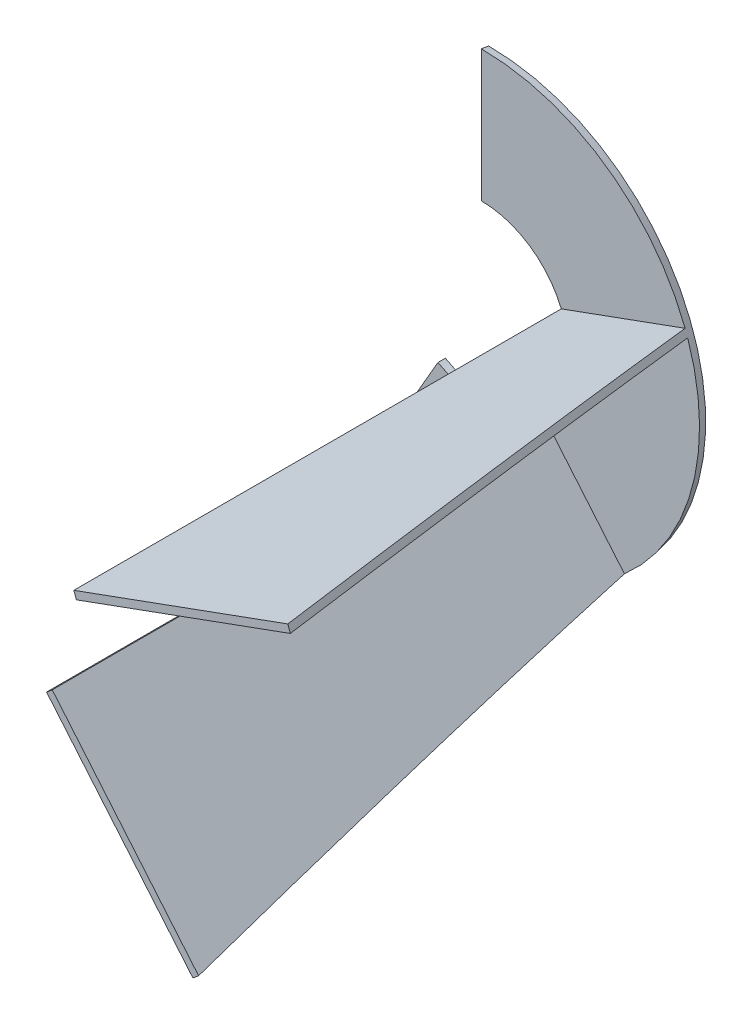
ISO-10303-21;
HEADER;
FILE_DESCRIPTION(('STEP AP214'),'2;1');
FILE_NAME('part.step','',(''),(''),'','','');
FILE_SCHEMA(('AUTOMOTIVE_DESIGN { 1 0 10303 214 1 1 1 1 }'));
ENDSEC;
DATA;
#1=APPLICATION_CONTEXT('core data for automotive mechanical design processes');
#2=APPLICATION_PROTOCOL_DEFINITION('international standard','automotive_design',2000,#1);
#3=PRODUCT_CONTEXT('',#1,'mechanical');
#4=PRODUCT('Part','Part','',(#3));
#5=PRODUCT_RELATED_PRODUCT_CATEGORY('part','',(#4));
#6=PRODUCT_DEFINITION_FORMATION('','',#4);
#7=PRODUCT_DEFINITION_CONTEXT('part definition',#1,'design');
#8=PRODUCT_DEFINITION('design','',#6,#7);
#9=PRODUCT_DEFINITION_SHAPE('','',#8);
#10=(LENGTH_UNIT() NAMED_UNIT(*) SI_UNIT(.MILLI.,.METRE.));
#11=(NAMED_UNIT(*) PLANE_ANGLE_UNIT() SI_UNIT($,.RADIAN.));
#12=(NAMED_UNIT(*) SI_UNIT($,.STERADIAN.) SOLID_ANGLE_UNIT());
#13=UNCERTAINTY_MEASURE_WITH_UNIT(LENGTH_MEASURE(1.E-05),#10,'distance_accuracy_value','');
#14=(GEOMETRIC_REPRESENTATION_CONTEXT(3) GLOBAL_UNCERTAINTY_ASSIGNED_CONTEXT((#13)) GLOBAL_UNIT_ASSIGNED_CONTEXT((#10,
#11,#12)) REPRESENTATION_CONTEXT('',''));
#15=CARTESIAN_POINT('',(0.,0.,0.));
#16=DIRECTION('',(0.,0.,1.));
#17=DIRECTION('',(1.,0.,0.));
#18=AXIS2_PLACEMENT_3D('',#15,#16,#17);
#19=CARTESIAN_POINT('',(-87.4510900266484,6.49566910726212,0.));
#20=CARTESIAN_POINT('',(-125.095140394617,-21.9135996506971,200.));
#21=CARTESIAN_POINT('',(-100.442428241173,-168.406510946035,0.));
#22=CARTESIAN_POINT('',(-81.267941093223,-272.103880439931,200.));
#23=CARTESIAN_POINT('',(74.4597518121241,-181.397849160559,0.));
#24=CARTESIAN_POINT('',(168.922339696011,-228.276681138537,200.));
#25=CARTESIAN_POINT('',(87.4510900266484,-6.49566910726216,0.));
#26=CARTESIAN_POINT('',(125.095140394617,21.913599650697,200.));
#27=CARTESIAN_POINT('',(100.442428241173,168.406510946035,0.));
#28=CARTESIAN_POINT('',(81.2679410932231,272.103880439931,200.));
#29=CARTESIAN_POINT('',(-74.4597518121241,181.397849160559,0.));
#30=CARTESIAN_POINT('',(-168.922339696011,228.276681138537,200.));
#31=CARTESIAN_POINT('',(-87.4510900266484,6.49566910726212,0.));
#32=CARTESIAN_POINT('',(-125.095140394617,-21.9135996506971,200.));
#33=(BOUNDED_SURFACE() B_SPLINE_SURFACE(3,1,((#19,#20),(#21,#22),(#23,#24),(#25,#26),(#27,#28),
(#29,#30),(#31,#32)),.UNSPECIFIED.,.T.,.F.,.F.) B_SPLINE_SURFACE_WITH_KNOTS((4,3,4),(2,2),(0.,
0.5,1.),(0.,1.),.UNSPECIFIED.) GEOMETRIC_REPRESENTATION_ITEM() RATIONAL_B_SPLINE_SURFACE(((1.,
1.),(0.333333333333334,0.333333333333334),(0.333333333333334,0.333333333333334),(1.,1.),
(0.333333333333333,0.333333333333333),(0.333333333333333,0.333333333333333),(1.,1.))) REPRESENTATION_ITEM('') SURFACE());
#34=CARTESIAN_POINT('',(0.,0.,200.));
#35=DIRECTION('',(0.,0.,1.));
#36=DIRECTION('',(1.,0.,0.));
#37=AXIS2_PLACEMENT_3D('',#34,#35,#36);
#38=CIRCLE('',#37,127.);
#39=CARTESIAN_POINT('',(80.479265582188,-98.2450396272079,200.));
#40=VERTEX_POINT('',#39);
#41=CARTESIAN_POINT('',(82.777398911545,-96.3166767981483,200.));
#42=VERTEX_POINT('',#41);
#43=EDGE_CURVE('E304',#40,#42,#38,.T.);
#44=CARTESIAN_POINT('',(80.4792655821881,-98.2450396272079,200.));
#45=CARTESIAN_POINT('',(79.8258986955483,-97.4663872927729,195.15787414735));
#46=CARTESIAN_POINT('',(79.1744886529553,-96.6900670342607,190.315108471509));
#47=CARTESIAN_POINT('',(77.875904815618,-95.1424750808292,180.628190339728));
#48=CARTESIAN_POINT('',(77.2287310313074,-94.3712033983442,175.784037880403));
#49=CARTESIAN_POINT('',(75.9389449465244,-92.834096198126,166.094258801684));
#50=CARTESIAN_POINT('',(75.2963326499015,-92.0682606849805,161.248632181051));
#51=CARTESIAN_POINT('',(74.0160222202433,-90.5424461307995,151.555706284349));
#52=CARTESIAN_POINT('',(73.3783241861355,-89.7824672076612,146.70840697665));
#53=CARTESIAN_POINT('',(72.1082543767335,-88.2688569494609,137.012122894263));
#54=CARTESIAN_POINT('',(71.4758825975654,-87.5152256097822,132.163138120803));
#55=CARTESIAN_POINT('',(70.2169081151739,-86.0148382474076,122.463359330206));
#56=CARTESIAN_POINT('',(69.5903054088664,-85.2680822210364,117.612565314037));
#57=CARTESIAN_POINT('',(67.7936105986119,-83.1268647261203,103.631129904761));
#58=CARTESIAN_POINT('',(66.6314530237928,-81.7418592611689,94.4980162577177));
#59=CARTESIAN_POINT('',(64.3329726262792,-79.0026369899247,76.223994994572));
#60=CARTESIAN_POINT('',(63.1966495743179,-77.6484199104022,67.0830874483839));
#61=CARTESIAN_POINT('',(61.5148886903606,-75.6441753350617,53.3645224337641));
#62=CARTESIAN_POINT('',(60.9580621199263,-74.9805752692946,48.790241122104));
#63=CARTESIAN_POINT('',(59.8526683944306,-73.663218325704,39.6392649211112));
#64=CARTESIAN_POINT('',(59.3041012345709,-73.009461442162,35.0625700331823));
#65=CARTESIAN_POINT('',(58.2159287358204,-71.7126279574139,25.9065269590137));
#66=CARTESIAN_POINT('',(57.6763235368623,-71.069551522973,21.3271787324979));
#67=CARTESIAN_POINT('',(56.6068912000624,-69.7950516935553,12.1657107224982));
#68=CARTESIAN_POINT('',(56.0770640823663,-69.1636283225872,7.58359093332422));
#69=CARTESIAN_POINT('',(55.5525308558803,-68.5385139654875,3.00000000000001));
#70=B_SPLINE_CURVE_WITH_KNOTS('',3,(#44,#45,#46,#47,#48,#49,#50,#51,#52,#53,#54,#55,#56,#57,#58,
#59,#60,#61,#62,#63,#64,#65,#66,#67,#68,#69),.UNSPECIFIED.,.F.,.F.,(4,2,2,2,2,2,2,2,2,2,2,2,4),
(0.,14.8429895337898,29.686015611385,44.5290542137138,59.3723908402982,74.2157166702322,
89.0590345647813,116.990006932346,144.920731331384,158.887470726775,172.854202007863,
186.82115116169,200.788129088241),.UNSPECIFIED.);
#71=CARTESIAN_POINT('',(55.5525308558803,-68.5385139654875,3.));
#72=VERTEX_POINT('',#71);
#73=EDGE_CURVE('E389',#40,#72,#70,.T.);
#74=CARTESIAN_POINT('',(0.,0.,3.));
#75=DIRECTION('',(0.,0.,1.));
#76=DIRECTION('',(1.,0.,0.));
#77=AXIS2_PLACEMENT_3D('',#74,#75,#76);
#78=CIRCLE('',#77,88.2247787250887);
#79=CARTESIAN_POINT('',(-44.1123893625439,-76.4048996191879,3.));
#80=VERTEX_POINT('',#79);
#81=EDGE_CURVE('E393',#72,#80,#78,.F.);
#82=CARTESIAN_POINT('',(-63.4999999999993,-109.985226280624,200.));
#83=CARTESIAN_POINT('',(-62.9918050443149,-109.105006797228,195.157862814135));
#84=CARTESIAN_POINT('',(-62.4851329677572,-108.227425017854,190.315085545337));
#85=CARTESIAN_POINT('',(-61.4750855690972,-106.477971605322,180.628143787621));
#86=CARTESIAN_POINT('',(-60.9717102550489,-105.606099986115,175.783979295344));
#87=CARTESIAN_POINT('',(-59.9685094440528,-103.868505211275,166.094175646622));
#88=CARTESIAN_POINT('',(-59.4686839500642,-103.002782060768,161.24853648895));
#89=CARTESIAN_POINT('',(-58.4728565784787,-101.277958457615,151.555578822597));
#90=CARTESIAN_POINT('',(-57.9768547827149,-100.418858146706,146.708260280281));
#91=CARTESIAN_POINT('',(-56.9889960386355,-98.7078366112596,137.011937090917));
#92=CARTESIAN_POINT('',(-56.4971390873482,-97.8559153815739,132.16293244508));
#93=CARTESIAN_POINT('',(-55.5179147336459,-96.1598490489527,122.46311321015));
#94=CARTESIAN_POINT('',(-55.0305473289263,-95.3157039420254,117.612298621988));
#95=CARTESIAN_POINT('',(-53.6082178048955,-92.8521569412988,103.381928799494));
#96=CARTESIAN_POINT('',(-52.6799050105118,-91.24427201611,93.9997100770592));
#97=CARTESIAN_POINT('',(-50.8445827044154,-88.0654005336864,75.2270194397784));
#98=CARTESIAN_POINT('',(-49.937572989613,-86.4944136246902,65.8365476044983));
#99=CARTESIAN_POINT('',(-48.5958812721245,-84.1705354019058,51.7431632196798));
#100=CARTESIAN_POINT('',(-48.1517648480518,-83.401303190936,47.0438402078543));
#101=CARTESIAN_POINT('',(-47.2703910750344,-81.8747190356112,37.6426233430513));
#102=CARTESIAN_POINT('',(-46.8331337216448,-81.1173670835573,32.9407294917418));
#103=CARTESIAN_POINT('',(-45.9660787641127,-79.6155838441571,23.5341070341163));
#104=CARTESIAN_POINT('',(-45.5362812865867,-78.8711527761173,18.8293783810847));
#105=CARTESIAN_POINT('',(-44.6848466474256,-77.396424721766,9.4169580477619));
#106=CARTESIAN_POINT('',(-44.2632095045406,-76.6661277679309,4.7092663606881));
#107=CARTESIAN_POINT('',(-43.8459999999996,-75.9434997086652,0.));
#108=B_SPLINE_CURVE_WITH_KNOTS('',3,(#82,#83,#84,#85,#86,#87,#88,#89,#90,#91,#92,#93,#94,#95,
#96,#97,#98,#99,#100,#101,#102,#103,#104,#105,#106,#107),.UNSPECIFIED.,.F.,.F.,(4,2,2,2,2,2,2,2,
2,2,2,2,4),(0.,14.8429805767852,29.6859974010277,44.529026597607,59.3723725807232,
74.2157079200028,89.0590356392168,117.751420452957,146.443531621257,160.791105142822,
175.138669366289,189.48647687351,203.834317344135),.UNSPECIFIED.);
#109=CARTESIAN_POINT('',(-43.8459999999996,-75.9434997086652,0.));
#110=VERTEX_POINT('',#109);
#111=EDGE_CURVE('E190',#80,#110,#108,.T.);
#112=CARTESIAN_POINT('',(0.,0.,0.));
#113=DIRECTION('',(0.,0.,1.));
#114=DIRECTION('',(1.,0.,0.));
#115=AXIS2_PLACEMENT_3D('',#112,#113,#114);
#116=CIRCLE('',#115,87.692);
#117=CARTESIAN_POINT('',(1.17799163178258E-13,87.692,0.));
#118=VERTEX_POINT('',#117);
#119=EDGE_CURVE('E220',#110,#118,#116,.T.);
#120=CARTESIAN_POINT('',(0.,127.,200.));
#121=CARTESIAN_POINT('',(0.,125.983610088631,195.157862814135));
#122=CARTESIAN_POINT('',(0.,124.970265935516,190.315085545337));
#123=CARTESIAN_POINT('',(0.,122.950171138196,180.628143787621));
#124=CARTESIAN_POINT('',(0.,121.943420510099,175.783979295344));
#125=CARTESIAN_POINT('',(0.,119.937018888107,166.094175646622));
#126=CARTESIAN_POINT('',(0.,118.93736790013,161.24853648895));
#127=CARTESIAN_POINT('',(0.,116.945713156959,151.555578822597));
#128=CARTESIAN_POINT('',(0.,115.953709565431,146.708260280281));
#129=CARTESIAN_POINT('',(0.,113.977992077272,137.011937090917));
#130=CARTESIAN_POINT('',(0.,112.994278174697,132.16293244508));
#131=CARTESIAN_POINT('',(0.,111.035829467293,122.46311321015));
#132=CARTESIAN_POINT('',(0.,110.061094657854,117.612298621988));
#133=CARTESIAN_POINT('',(0.,107.216435609792,103.381928799494));
#134=CARTESIAN_POINT('',(0.,105.359810021025,93.9997100770591));
#135=CARTESIAN_POINT('',(0.,101.689165408832,75.2270194397784));
#136=CARTESIAN_POINT('',(0.,99.875145979227,65.8365476044983));
#137=CARTESIAN_POINT('',(0.,97.1917625442501,51.7431632196798));
#138=CARTESIAN_POINT('',(0.,96.3035296961046,47.0438402078543));
#139=CARTESIAN_POINT('',(0.,94.5407821500698,37.6426233430513));
#140=CARTESIAN_POINT('',(0.,93.6662674432906,32.9407294917418));
#141=CARTESIAN_POINT('',(0.,91.9321575282263,23.5341070341163));
#142=CARTESIAN_POINT('',(0.,91.0725625731745,18.8293783810847));
#143=CARTESIAN_POINT('',(0.,89.3696932948521,9.4169580477619));
#144=CARTESIAN_POINT('',(0.,88.526419009082,4.7092663606881));
#145=CARTESIAN_POINT('',(1.17799163178258E-13,87.692,0.));
#146=B_SPLINE_CURVE_WITH_KNOTS('',3,(#120,#121,#122,#123,#124,#125,#126,#127,#128,#129,#130,
#131,#132,#133,#134,#135,#136,#137,#138,#139,#140,#141,#142,#143,#144,#145),.UNSPECIFIED.,.F.,
.F.,(4,2,2,2,2,2,2,2,2,2,2,2,4),(0.,14.8429805767853,29.6859974010277,44.529026597607,
59.3723725807232,74.2157079200028,89.0590356392168,117.751420452957,146.443531621257,
160.791105142822,175.138669366289,189.48647687351,203.834317344135),.UNSPECIFIED.);
#147=CARTESIAN_POINT('',(0.,88.2247787250886,3.));
#148=VERTEX_POINT('',#147);
#149=EDGE_CURVE('E223',#148,#118,#146,.T.);
#150=CARTESIAN_POINT('',(0.,0.,3.));
#151=DIRECTION('',(0.,0.,1.));
#152=DIRECTION('',(1.,0.,0.));
#153=AXIS2_PLACEMENT_3D('',#150,#151,#152);
#154=CIRCLE('',#153,88.2247787250886);
#155=CARTESIAN_POINT('',(82.3791599484552,31.5798288038058,3.));
#156=VERTEX_POINT('',#155);
#157=EDGE_CURVE('E351',#148,#156,#154,.F.);
#158=CARTESIAN_POINT('',(118.819608285694,44.8430673218758,200.));
#159=CARTESIAN_POINT('',(117.864449796655,44.4954180628589,195.15787414735));
#160=CARTESIAN_POINT('',(116.912152022233,44.1488100188114,190.315108471509));
#161=CARTESIAN_POINT('',(115.013749453439,43.457847991116,180.628190339728));
#162=CARTESIAN_POINT('',(114.06764467432,43.1134940130198,175.784037880403));
#163=CARTESIAN_POINT('',(112.182103559341,42.4272131716824,166.094258801684));
#164=CARTESIAN_POINT('',(111.242667229109,42.0852863104895,161.248632181051));
#165=CARTESIAN_POINT('',(109.370978595204,41.4040473599338,151.555706284349));
#166=CARTESIAN_POINT('',(108.438726436154,41.0647353232093,146.70840697665));
#167=CARTESIAN_POINT('',(106.582008587532,40.3889452928801,137.012122894263));
#168=CARTESIAN_POINT('',(105.657542892297,40.0524672972143,132.163138120803));
#169=CARTESIAN_POINT('',(103.817045326642,39.3825809670765,122.463359330206));
#170=CARTESIAN_POINT('',(102.901013451714,39.0491726309637,117.612565314037));
#171=CARTESIAN_POINT('',(100.274421355728,38.0931712904659,103.631129904761));
#172=CARTESIAN_POINT('',(98.5754606402588,37.4748001608473,94.4980162577178));
#173=CARTESIAN_POINT('',(95.2153070902893,36.2518042860946,76.223994994572));
#174=CARTESIAN_POINT('',(93.5541139206237,35.64717941897,67.0830874483839));
#175=CARTESIAN_POINT('',(91.0955439843555,34.7523331433066,53.3645224337641));
#176=CARTESIAN_POINT('',(90.2815179959737,34.4560519136165,48.7902411221041));
#177=CARTESIAN_POINT('',(88.6655404767152,33.867884197363,39.6392649211113));
#178=CARTESIAN_POINT('',(87.8635889388238,33.5759977082466,35.0625700331823));
#179=CARTESIAN_POINT('',(86.2727871688322,32.9969932153517,25.9065269590138));
#180=CARTESIAN_POINT('',(85.4839371412999,32.7098752860298,21.3271787324979));
#181=CARTESIAN_POINT('',(83.9205316552938,32.1408422250351,12.1657107224982));
#182=CARTESIAN_POINT('',(83.145976226271,31.8589271040815,7.58359093332422));
#183=CARTESIAN_POINT('',(82.3791599484553,31.5798288038058,3.00000000000001));
#184=B_SPLINE_CURVE_WITH_KNOTS('',3,(#158,#159,#160,#161,#162,#163,#164,#165,#166,#167,#168,
#169,#170,#171,#172,#173,#174,#175,#176,#177,#178,#179,#180,#181,#182,#183),.UNSPECIFIED.,.F.,
.F.,(4,2,2,2,2,2,2,2,2,2,2,2,4),(0.,14.8429895337898,29.686015611385,44.5290542137138,
59.3723908402981,74.2157166702321,89.0590345647812,116.990006932346,144.920731331384,
158.887470726775,172.854202007863,186.82115116169,200.788129088241),.UNSPECIFIED.);
#185=CARTESIAN_POINT('',(118.819608285694,44.8430673218758,200.));
#186=VERTEX_POINT('',#185);
#187=EDGE_CURVE('E349',#186,#156,#184,.T.);
#188=CARTESIAN_POINT('',(119.845668715671,42.0239894595181,200.));
#189=VERTEX_POINT('',#188);
#190=EDGE_CURVE('E289',#189,#186,#38,.T.);
#191=CARTESIAN_POINT('',(119.845668715671,42.0239894595181,200.));
#192=CARTESIAN_POINT('',(118.890510226632,41.6763402005012,195.15787414735));
#193=CARTESIAN_POINT('',(117.93821245221,41.3297321564537,190.315108471509));
#194=CARTESIAN_POINT('',(116.039809883416,40.6387701287583,180.628190339728));
#195=CARTESIAN_POINT('',(115.093705104297,40.294416150662,175.784037880403));
#196=CARTESIAN_POINT('',(113.208163989318,39.6081353093246,166.094258801684));
#197=CARTESIAN_POINT('',(112.268727659086,39.2662084481318,161.248632181051));
#198=CARTESIAN_POINT('',(110.397039025181,38.5849694975761,151.555706284349));
#199=CARTESIAN_POINT('',(109.464786866131,38.2456574608515,146.70840697665));
#200=CARTESIAN_POINT('',(107.608069017509,37.5698674305224,137.012122894263));
#201=CARTESIAN_POINT('',(106.683603322274,37.2333894348565,132.163138120803));
#202=CARTESIAN_POINT('',(104.843105756619,36.5635031047188,122.463359330206));
#203=CARTESIAN_POINT('',(103.927073881691,36.230094768606,117.612565314037));
#204=CARTESIAN_POINT('',(101.300481785705,35.2740934281082,103.631129904761));
#205=CARTESIAN_POINT('',(99.6015210702358,34.6557222984896,94.4980162577177));
#206=CARTESIAN_POINT('',(96.2413675202663,33.4327264237368,76.223994994572));
#207=CARTESIAN_POINT('',(94.5801743506007,32.8281015566122,67.0830874483839));
#208=CARTESIAN_POINT('',(92.1216044143325,31.9332552809489,53.3645224337641));
#209=CARTESIAN_POINT('',(91.3075784259507,31.6369740512588,48.790241122104));
#210=CARTESIAN_POINT('',(89.6916009066922,31.0488063350053,39.6392649211113));
#211=CARTESIAN_POINT('',(88.8896493688008,30.7569198458888,35.0625700331823));
#212=CARTESIAN_POINT('',(87.2988475988092,30.1779153529939,25.9065269590137));
#213=CARTESIAN_POINT('',(86.5099975712769,29.8907974236721,21.3271787324979));
#214=CARTESIAN_POINT('',(84.9465920852708,29.3217643626774,12.1657107224982));
#215=CARTESIAN_POINT('',(84.172036656248,29.0398492417238,7.58359093332423));
#216=CARTESIAN_POINT('',(83.4052203784323,28.7607509414481,3.00000000000001));
#217=B_SPLINE_CURVE_WITH_KNOTS('',3,(#191,#192,#193,#194,#195,#196,#197,#198,#199,#200,#201,
#202,#203,#204,#205,#206,#207,#208,#209,#210,#211,#212,#213,#214,#215,#216),.UNSPECIFIED.,.F.,
.F.,(4,2,2,2,2,2,2,2,2,2,2,2,4),(0.,14.8429895337898,29.686015611385,44.5290542137138,
59.3723908402981,74.2157166702321,89.0590345647812,116.990006932346,144.920731331384,
158.887470726775,172.854202007863,186.82115116169,200.788129088241),.UNSPECIFIED.);
#218=CARTESIAN_POINT('',(83.4052203784322,28.7607509414481,3.));
#219=VERTEX_POINT('',#218);
#220=EDGE_CURVE('E314',#189,#219,#217,.T.);
#221=CARTESIAN_POINT('',(0.,0.,3.));
#222=DIRECTION('',(0.,0.,1.));
#223=DIRECTION('',(1.,0.,0.));
#224=AXIS2_PLACEMENT_3D('',#221,#222,#223);
#225=CIRCLE('',#224,88.2247787250886);
#226=CARTESIAN_POINT('',(57.8506641852373,-66.6101511364279,3.));
#227=VERTEX_POINT('',#226);
#228=EDGE_CURVE('E306',#219,#227,#225,.F.);
#229=CARTESIAN_POINT('',(82.777398911545,-96.3166767981483,200.));
#230=CARTESIAN_POINT('',(82.1240320249052,-95.5380244637133,195.15787414735));
#231=CARTESIAN_POINT('',(81.4726219823122,-94.7617042052011,190.315108471509));
#232=CARTESIAN_POINT('',(80.1740381449749,-93.2141122517695,180.628190339728));
#233=CARTESIAN_POINT('',(79.5268643606643,-92.4428405692846,175.784037880403));
#234=CARTESIAN_POINT('',(78.2370782758813,-90.9057333690664,166.094258801684));
#235=CARTESIAN_POINT('',(77.5944659792585,-90.1398978559209,161.248632181051));
#236=CARTESIAN_POINT('',(76.3141555496002,-88.6140833017399,151.555706284349));
#237=CARTESIAN_POINT('',(75.6764575154924,-87.8541043786016,146.70840697665));
#238=CARTESIAN_POINT('',(74.4063877060904,-86.3404941204013,137.012122894263));
#239=CARTESIAN_POINT('',(73.7740159269224,-85.5868627807226,132.163138120803));
#240=CARTESIAN_POINT('',(72.5150414445309,-84.086475418348,122.463359330206));
#241=CARTESIAN_POINT('',(71.8884387382234,-83.3397193919768,117.612565314037));
#242=CARTESIAN_POINT('',(70.0917439279689,-81.1985018970607,103.631129904761));
#243=CARTESIAN_POINT('',(68.9295863531497,-79.8134964321093,94.4980162577177));
#244=CARTESIAN_POINT('',(66.6311059556361,-77.074274160865,76.223994994572));
#245=CARTESIAN_POINT('',(65.4947829036748,-75.7200570813425,67.0830874483839));
#246=CARTESIAN_POINT('',(63.8130220197176,-73.7158125060021,53.3645224337641));
#247=CARTESIAN_POINT('',(63.2561954492833,-73.0522124402351,48.790241122104));
#248=CARTESIAN_POINT('',(62.1508017237875,-71.7348554966444,39.6392649211112));
#249=CARTESIAN_POINT('',(61.6022345639278,-71.0810986131024,35.0625700331823));
#250=CARTESIAN_POINT('',(60.5140620651774,-69.7842651283543,25.9065269590137));
#251=CARTESIAN_POINT('',(59.9744568662192,-69.1411886939134,21.3271787324979));
#252=CARTESIAN_POINT('',(58.9050245294194,-67.8666888644957,12.1657107224982));
#253=CARTESIAN_POINT('',(58.3751974117233,-67.2352654935276,7.58359093332421));
#254=CARTESIAN_POINT('',(57.8506641852373,-66.6101511364279,2.99999999999999));
#255=B_SPLINE_CURVE_WITH_KNOTS('',3,(#229,#230,#231,#232,#233,#234,#235,#236,#237,#238,#239,
#240,#241,#242,#243,#244,#245,#246,#247,#248,#249,#250,#251,#252,#253,#254),.UNSPECIFIED.,.F.,
.F.,(4,2,2,2,2,2,2,2,2,2,2,2,4),(0.,14.8429895337898,29.686015611385,44.5290542137138,
59.3723908402982,74.2157166702322,89.0590345647813,116.990006932346,144.920731331384,
158.887470726775,172.854202007863,186.82115116169,200.788129088241),.UNSPECIFIED.);
#256=EDGE_CURVE('E311',#42,#227,#255,.T.);
#257=ORIENTED_EDGE('',*,*,#43,.F.);
#258=ORIENTED_EDGE('',*,*,#73,.T.);
#259=ORIENTED_EDGE('',*,*,#81,.T.);
#260=ORIENTED_EDGE('',*,*,#111,.T.);
#261=ORIENTED_EDGE('',*,*,#119,.T.);
#262=ORIENTED_EDGE('',*,*,#149,.F.);
#263=ORIENTED_EDGE('',*,*,#157,.T.);
#264=ORIENTED_EDGE('',*,*,#187,.F.);
#265=ORIENTED_EDGE('',*,*,#190,.F.);
#266=ORIENTED_EDGE('',*,*,#220,.T.);
#267=ORIENTED_EDGE('',*,*,#228,.T.);
#268=ORIENTED_EDGE('',*,*,#256,.F.);
#269=EDGE_LOOP('',(#257,#258,#259,#260,#261,#262,#263,#264,#265,#266,#267,#268));
#270=FACE_BOUND('',#269,.T.);
#271=ADVANCED_FACE('F84',(#270),#33,.T.);
#272=CARTESIAN_POINT('',(0.,0.,-85.));
#273=DIRECTION('',(0.,0.,1.));
#274=DIRECTION('',(1.,0.,0.));
#275=AXIS2_PLACEMENT_3D('',#272,#273,#274);
#276=CYLINDRICAL_SURFACE('',#275,35.);
#277=DIRECTION('',(0.,0.,1.));
#278=VECTOR('',#277,1.);
#279=CARTESIAN_POINT('',(21.3278291481083,-27.7511027497846,3.));
#280=LINE('',#279,#278);
#281=CARTESIAN_POINT('',(21.3278291481083,-27.7511027497846,3.));
#282=VERTEX_POINT('',#281);
#283=CARTESIAN_POINT('',(21.3278291481083,-27.7511027497846,200.));
#284=VERTEX_POINT('',#283);
#285=EDGE_CURVE('E191',#282,#284,#280,.T.);
#286=ORIENTED_EDGE('',*,*,#285,.T.);
#287=CARTESIAN_POINT('',(0.,0.,200.));
#288=DIRECTION('',(0.,0.,1.));
#289=DIRECTION('',(1.,0.,0.));
#290=AXIS2_PLACEMENT_3D('',#287,#288,#289);
#291=CIRCLE('',#290,35.);
#292=CARTESIAN_POINT('',(23.6259624774653,-25.822739920725,200.));
#293=VERTEX_POINT('',#292);
#294=EDGE_CURVE('E203',#284,#293,#291,.T.);
#295=ORIENTED_EDGE('',*,*,#294,.T.);
#296=DIRECTION('',(0.,0.,1.));
#297=VECTOR('',#296,1.);
#298=CARTESIAN_POINT('',(23.6259624774653,-25.822739920725,3.));
#299=LINE('',#298,#297);
#300=CARTESIAN_POINT('',(23.6259624774653,-25.822739920725,3.));
#301=VERTEX_POINT('',#300);
#302=EDGE_CURVE('E297',#301,#293,#299,.T.);
#303=ORIENTED_EDGE('',*,*,#302,.F.);
#304=CARTESIAN_POINT('',(0.,0.,3.));
#305=DIRECTION('',(0.,0.,1.));
#306=DIRECTION('',(1.,0.,0.));
#307=AXIS2_PLACEMENT_3D('',#304,#305,#306);
#308=CIRCLE('',#307,35.);
#309=CARTESIAN_POINT('',(33.3720536547054,10.5501675279334,3.));
#310=VERTEX_POINT('',#309);
#311=EDGE_CURVE('E391',#310,#301,#308,.F.);
#312=ORIENTED_EDGE('',*,*,#311,.F.);
#313=DIRECTION('',(0.,0.,1.));
#314=VECTOR('',#313,1.);
#315=CARTESIAN_POINT('',(33.3720536547054,10.5501675279334,3.));
#316=LINE('',#315,#314);
#317=CARTESIAN_POINT('',(33.3720536547054,10.5501675279334,200.));
#318=VERTEX_POINT('',#317);
#319=EDGE_CURVE('E300',#310,#318,#316,.T.);
#320=ORIENTED_EDGE('',*,*,#319,.T.);
#321=CARTESIAN_POINT('',(32.3459932247285,13.3692453902912,200.));
#322=VERTEX_POINT('',#321);
#323=EDGE_CURVE('E291',#318,#322,#291,.T.);
#324=ORIENTED_EDGE('',*,*,#323,.T.);
#325=DIRECTION('',(0.,0.,1.));
#326=VECTOR('',#325,1.);
#327=CARTESIAN_POINT('',(32.3459932247285,13.3692453902912,3.));
#328=LINE('',#327,#326);
#329=CARTESIAN_POINT('',(32.3459932247285,13.3692453902912,3.));
#330=VERTEX_POINT('',#329);
#331=EDGE_CURVE('E354',#330,#322,#328,.T.);
#332=ORIENTED_EDGE('',*,*,#331,.F.);
#333=CARTESIAN_POINT('',(0.,0.,3.));
#334=DIRECTION('',(0.,0.,1.));
#335=DIRECTION('',(1.,0.,0.));
#336=AXIS2_PLACEMENT_3D('',#333,#334,#335);
#337=CIRCLE('',#336,35.);
#338=CARTESIAN_POINT('',(0.,35.,3.));
#339=VERTEX_POINT('',#338);
#340=EDGE_CURVE('E358',#339,#330,#337,.F.);
#341=ORIENTED_EDGE('',*,*,#340,.F.);
#342=DIRECTION('',(0.,0.,1.));
#343=VECTOR('',#342,1.);
#344=CARTESIAN_POINT('',(0.,35.,-85.));
#345=LINE('',#344,#343);
#346=CARTESIAN_POINT('',(0.,35.,0.));
#347=VERTEX_POINT('',#346);
#348=EDGE_CURVE('E197',#347,#339,#345,.T.);
#349=ORIENTED_EDGE('',*,*,#348,.F.);
#350=CARTESIAN_POINT('',(0.,0.,0.));
#351=DIRECTION('',(0.,0.,1.));
#352=DIRECTION('',(1.,0.,0.));
#353=AXIS2_PLACEMENT_3D('',#350,#351,#352);
#354=CIRCLE('',#353,35.);
#355=CARTESIAN_POINT('',(-17.4999999999998,-30.3108891324555,0.));
#356=VERTEX_POINT('',#355);
#357=EDGE_CURVE('E94',#356,#347,#354,.T.);
#358=ORIENTED_EDGE('',*,*,#357,.F.);
#359=DIRECTION('',(0.,0.,1.));
#360=VECTOR('',#359,1.);
#361=CARTESIAN_POINT('',(-17.4999999999998,-30.3108891324555,-85.));
#362=LINE('',#361,#360);
#363=CARTESIAN_POINT('',(-17.4999999999998,-30.3108891324555,3.));
#364=VERTEX_POINT('',#363);
#365=EDGE_CURVE('E188',#356,#364,#362,.T.);
#366=ORIENTED_EDGE('',*,*,#365,.T.);
#367=CARTESIAN_POINT('',(0.,0.,3.));
#368=DIRECTION('',(0.,0.,1.));
#369=DIRECTION('',(1.,0.,0.));
#370=AXIS2_PLACEMENT_3D('',#367,#368,#369);
#371=CIRCLE('',#370,35.);
#372=EDGE_CURVE('E174',#282,#364,#371,.F.);
#373=ORIENTED_EDGE('',*,*,#372,.F.);
#374=EDGE_LOOP('',(#286,#295,#303,#312,#320,#324,#332,#341,#349,#358,#366,#373));
#375=FACE_BOUND('',#374,.T.);
#376=ADVANCED_FACE('F193',(#375),#276,.F.);
#377=CARTESIAN_POINT('',(0.,0.,200.));
#378=DIRECTION('',(0.,0.,1.));
#379=DIRECTION('',(1.,0.,0.));
#380=AXIS2_PLACEMENT_3D('',#377,#378,#379);
#381=PLANE('',#380);
#382=ORIENTED_EDGE('',*,*,#294,.F.);
#383=DIRECTION('',(0.642787609686535,-0.766044443118982,0.));
#384=VECTOR('',#383,1.);
#385=CARTESIAN_POINT('',(-1.14906666467848,-0.96418141452981,200.));
#386=LINE('',#385,#384);
#387=EDGE_CURVE('E428',#284,#40,#386,.T.);
#388=ORIENTED_EDGE('',*,*,#387,.T.);
#389=ORIENTED_EDGE('',*,*,#43,.T.);
#390=DIRECTION('',(0.642787609686535,-0.766044443118982,0.));
#391=VECTOR('',#390,1.);
#392=CARTESIAN_POINT('',(1.14906666467847,0.964181414529804,200.));
#393=LINE('',#392,#391);
#394=EDGE_CURVE('E385',#293,#42,#393,.T.);
#395=ORIENTED_EDGE('',*,*,#394,.F.);
#396=EDGE_LOOP('',(#382,#388,#389,#395));
#397=FACE_BOUND('',#396,.T.);
#398=ADVANCED_FACE('F86',(#397),#381,.T.);
#399=ORIENTED_EDGE('',*,*,#323,.F.);
#400=DIRECTION('',(0.93969262078591,0.342020143325666,0.));
#401=VECTOR('',#400,1.);
#402=CARTESIAN_POINT('',(0.5130302149885,-1.40953893117887,200.));
#403=LINE('',#402,#401);
#404=EDGE_CURVE('E378',#318,#189,#403,.T.);
#405=ORIENTED_EDGE('',*,*,#404,.T.);
#406=ORIENTED_EDGE('',*,*,#190,.T.);
#407=DIRECTION('',(0.93969262078591,0.342020143325666,0.));
#408=VECTOR('',#407,1.);
#409=CARTESIAN_POINT('',(-0.513030214988498,1.40953893117886,200.));
#410=LINE('',#409,#408);
#411=EDGE_CURVE('E357',#322,#186,#410,.T.);
#412=ORIENTED_EDGE('',*,*,#411,.F.);
#413=EDGE_LOOP('',(#399,#405,#406,#412));
#414=FACE_BOUND('',#413,.T.);
#415=ADVANCED_FACE('F250',(#414),#381,.T.);
#416=CARTESIAN_POINT('',(0.,0.,-85.));
#417=DIRECTION('',(1.,0.,0.));
#418=DIRECTION('',(0.,0.,-1.));
#419=AXIS2_PLACEMENT_3D('',#416,#417,#418);
#420=PLANE('',#419);
#421=DIRECTION('',(0.,-1.,0.));
#422=VECTOR('',#421,1.);
#423=CARTESIAN_POINT('',(0.,0.,3.));
#424=LINE('',#423,#422);
#425=EDGE_CURVE('E12',#148,#339,#424,.T.);
#426=ORIENTED_EDGE('',*,*,#425,.F.);
#427=ORIENTED_EDGE('',*,*,#149,.T.);
#428=DIRECTION('',(0.,1.,0.));
#429=VECTOR('',#428,1.);
#430=CARTESIAN_POINT('',(0.,0.,0.));
#431=LINE('',#430,#429);
#432=EDGE_CURVE('E196',#347,#118,#431,.T.);
#433=ORIENTED_EDGE('',*,*,#432,.F.);
#434=ORIENTED_EDGE('',*,*,#348,.T.);
#435=EDGE_LOOP('',(#426,#427,#433,#434));
#436=FACE_BOUND('',#435,.T.);
#437=ADVANCED_FACE('F245',(#436),#420,.F.);
#438=CARTESIAN_POINT('',(0.,0.,0.));
#439=DIRECTION('',(0.,0.,1.));
#440=DIRECTION('',(1.,0.,0.));
#441=AXIS2_PLACEMENT_3D('',#438,#439,#440);
#442=PLANE('',#441);
#443=DIRECTION('',(-0.499999999999995,-0.866025403784442,0.));
#444=VECTOR('',#443,1.);
#445=CARTESIAN_POINT('',(0.,0.,0.));
#446=LINE('',#445,#444);
#447=EDGE_CURVE('E200',#356,#110,#446,.T.);
#448=ORIENTED_EDGE('',*,*,#447,.F.);
#449=ORIENTED_EDGE('',*,*,#357,.T.);
#450=ORIENTED_EDGE('',*,*,#432,.T.);
#451=ORIENTED_EDGE('',*,*,#119,.F.);
#452=EDGE_LOOP('',(#448,#449,#450,#451));
#453=FACE_BOUND('',#452,.T.);
#454=ADVANCED_FACE('F249',(#453),#442,.F.);
#455=CARTESIAN_POINT('',(0.,0.,-85.));
#456=DIRECTION('',(-0.866025403784442,0.499999999999995,0.));
#457=DIRECTION('',(-0.499999999999995,-0.866025403784442,0.));
#458=AXIS2_PLACEMENT_3D('',#455,#456,#457);
#459=PLANE('',#458);
#460=DIRECTION('',(-0.499999999999995,-0.866025403784442,0.));
#461=VECTOR('',#460,1.);
#462=CARTESIAN_POINT('',(0.,0.,3.));
#463=LINE('',#462,#461);
#464=EDGE_CURVE('E177',#364,#80,#463,.T.);
#465=ORIENTED_EDGE('',*,*,#464,.F.);
#466=ORIENTED_EDGE('',*,*,#365,.F.);
#467=ORIENTED_EDGE('',*,*,#447,.T.);
#468=ORIENTED_EDGE('',*,*,#111,.F.);
#469=EDGE_LOOP('',(#465,#466,#467,#468));
#470=FACE_BOUND('',#469,.T.);
#471=ADVANCED_FACE('F186',(#470),#459,.T.);
#472=CARTESIAN_POINT('',(-0.513030214988498,1.40953893117886,3.));
#473=DIRECTION('',(0.342020143325666,-0.939692620785909,0.));
#474=DIRECTION('',(0.939692620785909,0.342020143325666,0.));
#475=AXIS2_PLACEMENT_3D('',#472,#473,#474);
#476=PLANE('',#475);
#477=ORIENTED_EDGE('',*,*,#187,.T.);
#478=DIRECTION('',(0.93969262078591,0.342020143325666,0.));
#479=VECTOR('',#478,1.);
#480=CARTESIAN_POINT('',(-0.513030214988498,1.40953893117886,3.));
#481=LINE('',#480,#479);
#482=EDGE_CURVE('E363',#330,#156,#481,.T.);
#483=ORIENTED_EDGE('',*,*,#482,.F.);
#484=ORIENTED_EDGE('',*,*,#331,.T.);
#485=ORIENTED_EDGE('',*,*,#411,.T.);
#486=EDGE_LOOP('',(#477,#483,#484,#485));
#487=FACE_BOUND('',#486,.T.);
#488=ADVANCED_FACE('F339',(#487),#476,.F.);
#489=CARTESIAN_POINT('',(0.,0.,3.));
#490=DIRECTION('',(0.,0.,1.));
#491=DIRECTION('',(1.,0.,0.));
#492=AXIS2_PLACEMENT_3D('',#489,#490,#491);
#493=PLANE('',#492);
#494=ORIENTED_EDGE('',*,*,#425,.T.);
#495=ORIENTED_EDGE('',*,*,#340,.T.);
#496=ORIENTED_EDGE('',*,*,#482,.T.);
#497=ORIENTED_EDGE('',*,*,#157,.F.);
#498=EDGE_LOOP('',(#494,#495,#496,#497));
#499=FACE_BOUND('',#498,.T.);
#500=ADVANCED_FACE('F337',(#499),#493,.T.);
#501=CARTESIAN_POINT('',(0.5130302149885,-1.40953893117887,3.));
#502=DIRECTION('',(0.342020143325666,-0.939692620785909,0.));
#503=DIRECTION('',(0.939692620785909,0.342020143325666,0.));
#504=AXIS2_PLACEMENT_3D('',#501,#502,#503);
#505=PLANE('',#504);
#506=ORIENTED_EDGE('',*,*,#404,.F.);
#507=ORIENTED_EDGE('',*,*,#319,.F.);
#508=DIRECTION('',(0.93969262078591,0.342020143325666,0.));
#509=VECTOR('',#508,1.);
#510=CARTESIAN_POINT('',(0.5130302149885,-1.40953893117887,3.));
#511=LINE('',#510,#509);
#512=EDGE_CURVE('E110',#310,#219,#511,.T.);
#513=ORIENTED_EDGE('',*,*,#512,.T.);
#514=ORIENTED_EDGE('',*,*,#220,.F.);
#515=EDGE_LOOP('',(#506,#507,#513,#514));
#516=FACE_BOUND('',#515,.T.);
#517=ADVANCED_FACE('F333',(#516),#505,.T.);
#518=CARTESIAN_POINT('',(1.14906666467847,0.964181414529804,3.));
#519=DIRECTION('',(-0.766044443118982,-0.642787609686535,0.));
#520=DIRECTION('',(0.642787609686535,-0.766044443118982,0.));
#521=AXIS2_PLACEMENT_3D('',#518,#519,#520);
#522=PLANE('',#521);
#523=ORIENTED_EDGE('',*,*,#256,.T.);
#524=DIRECTION('',(0.642787609686535,-0.766044443118982,0.));
#525=VECTOR('',#524,1.);
#526=CARTESIAN_POINT('',(1.14906666467847,0.964181414529804,3.));
#527=LINE('',#526,#525);
#528=EDGE_CURVE('E387',#301,#227,#527,.T.);
#529=ORIENTED_EDGE('',*,*,#528,.F.);
#530=ORIENTED_EDGE('',*,*,#302,.T.);
#531=ORIENTED_EDGE('',*,*,#394,.T.);
#532=EDGE_LOOP('',(#523,#529,#530,#531));
#533=FACE_BOUND('',#532,.T.);
#534=ADVANCED_FACE('F327',(#533),#522,.F.);
#535=CARTESIAN_POINT('',(0.,0.,3.));
#536=DIRECTION('',(0.,0.,1.));
#537=DIRECTION('',(1.,0.,0.));
#538=AXIS2_PLACEMENT_3D('',#535,#536,#537);
#539=PLANE('',#538);
#540=ORIENTED_EDGE('',*,*,#512,.F.);
#541=ORIENTED_EDGE('',*,*,#311,.T.);
#542=ORIENTED_EDGE('',*,*,#528,.T.);
#543=ORIENTED_EDGE('',*,*,#228,.F.);
#544=EDGE_LOOP('',(#540,#541,#542,#543));
#545=FACE_BOUND('',#544,.T.);
#546=ADVANCED_FACE('F332',(#545),#539,.T.);
#547=CARTESIAN_POINT('',(-1.14906666467848,-0.96418141452981,3.));
#548=DIRECTION('',(-0.766044443118982,-0.642787609686535,0.));
#549=DIRECTION('',(0.642787609686535,-0.766044443118982,0.));
#550=AXIS2_PLACEMENT_3D('',#547,#548,#549);
#551=PLANE('',#550);
#552=ORIENTED_EDGE('',*,*,#387,.F.);
#553=ORIENTED_EDGE('',*,*,#285,.F.);
#554=DIRECTION('',(0.642787609686535,-0.766044443118982,0.));
#555=VECTOR('',#554,1.);
#556=CARTESIAN_POINT('',(-1.14906666467848,-0.96418141452981,3.));
#557=LINE('',#556,#555);
#558=EDGE_CURVE('E102',#282,#72,#557,.T.);
#559=ORIENTED_EDGE('',*,*,#558,.T.);
#560=ORIENTED_EDGE('',*,*,#73,.F.);
#561=EDGE_LOOP('',(#552,#553,#559,#560));
#562=FACE_BOUND('',#561,.T.);
#563=ADVANCED_FACE('F411',(#562),#551,.T.);
#564=CARTESIAN_POINT('',(0.,0.,3.));
#565=DIRECTION('',(0.,0.,1.));
#566=DIRECTION('',(1.,0.,0.));
#567=AXIS2_PLACEMENT_3D('',#564,#565,#566);
#568=PLANE('',#567);
#569=ORIENTED_EDGE('',*,*,#558,.F.);
#570=ORIENTED_EDGE('',*,*,#372,.T.);
#571=ORIENTED_EDGE('',*,*,#464,.T.);
#572=ORIENTED_EDGE('',*,*,#81,.F.);
#573=EDGE_LOOP('',(#569,#570,#571,#572));
#574=FACE_BOUND('',#573,.T.);
#575=ADVANCED_FACE('F176',(#574),#568,.T.);
#576=CLOSED_SHELL('',(#271,#376,#398,#415,#437,#454,#471,#488,#500,#517,#534,#546,#563,#575));
#577=MANIFOLD_SOLID_BREP('B2',#576);
#578=ADVANCED_BREP_SHAPE_REPRESENTATION('',(#18,#577),#14);
#579=SHAPE_DEFINITION_REPRESENTATION(#9,#578);
ENDSEC;
END-ISO-10303-21;
